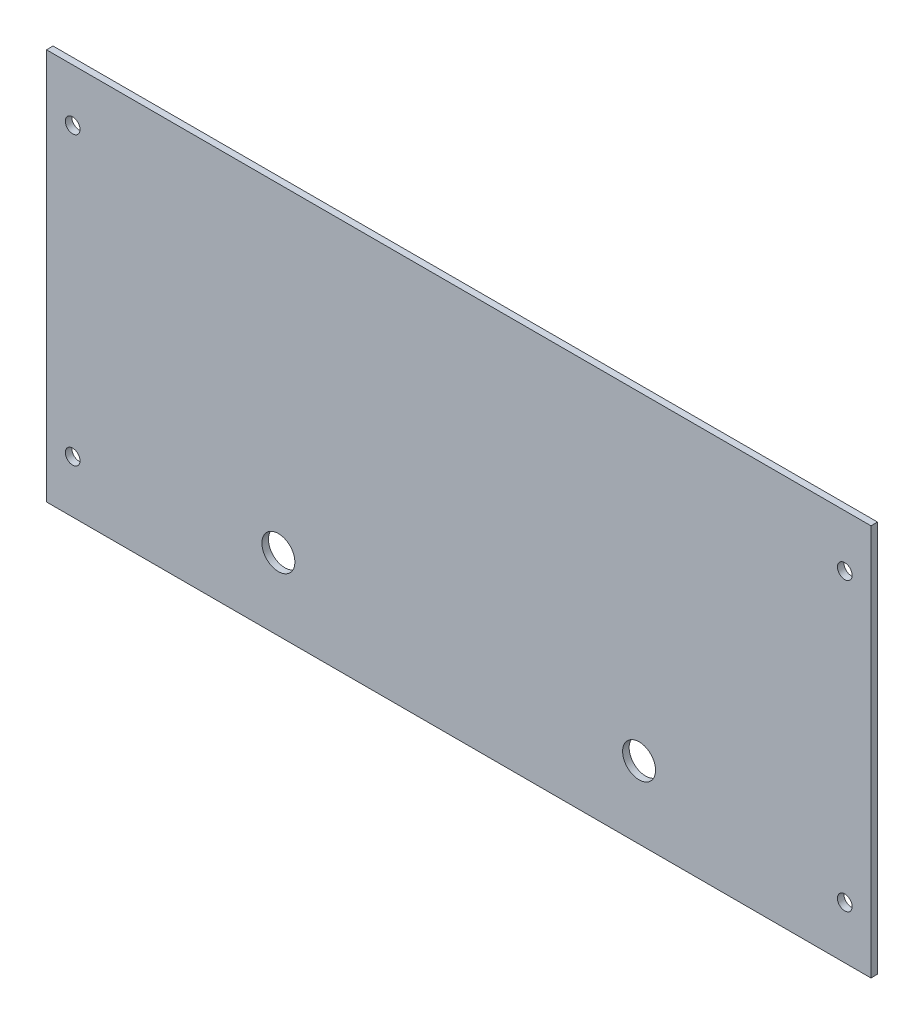
ISO-10303-21;
HEADER;
FILE_DESCRIPTION(('STEP AP214'),'2;1');
FILE_NAME('part.step','',(''),(''),'','','');
FILE_SCHEMA(('AUTOMOTIVE_DESIGN { 1 0 10303 214 1 1 1 1 }'));
ENDSEC;
DATA;
#1=APPLICATION_CONTEXT('core data for automotive mechanical design processes');
#2=APPLICATION_PROTOCOL_DEFINITION('international standard','automotive_design',2000,#1);
#3=PRODUCT_CONTEXT('',#1,'mechanical');
#4=PRODUCT('Part','Part','',(#3));
#5=PRODUCT_RELATED_PRODUCT_CATEGORY('part','',(#4));
#6=PRODUCT_DEFINITION_FORMATION('','',#4);
#7=PRODUCT_DEFINITION_CONTEXT('part definition',#1,'design');
#8=PRODUCT_DEFINITION('design','',#6,#7);
#9=PRODUCT_DEFINITION_SHAPE('','',#8);
#10=(LENGTH_UNIT() NAMED_UNIT(*) SI_UNIT(.MILLI.,.METRE.));
#11=(NAMED_UNIT(*) PLANE_ANGLE_UNIT() SI_UNIT($,.RADIAN.));
#12=(NAMED_UNIT(*) SI_UNIT($,.STERADIAN.) SOLID_ANGLE_UNIT());
#13=UNCERTAINTY_MEASURE_WITH_UNIT(LENGTH_MEASURE(1.E-05),#10,'distance_accuracy_value','');
#14=(GEOMETRIC_REPRESENTATION_CONTEXT(3) GLOBAL_UNCERTAINTY_ASSIGNED_CONTEXT((#13)) GLOBAL_UNIT_ASSIGNED_CONTEXT((#10,
#11,#12)) REPRESENTATION_CONTEXT('',''));
#15=CARTESIAN_POINT('',(0.,0.,0.));
#16=DIRECTION('',(0.,0.,1.));
#17=DIRECTION('',(1.,0.,0.));
#18=AXIS2_PLACEMENT_3D('',#15,#16,#17);
#19=CARTESIAN_POINT('',(0.,0.,3.175));
#20=DIRECTION('',(0.,0.,-1.));
#21=DIRECTION('',(-1.,0.,0.));
#22=AXIS2_PLACEMENT_3D('',#19,#20,#21);
#23=PLANE('',#22);
#24=DIRECTION('',(0.,1.,0.));
#25=VECTOR('',#24,1.);
#26=CARTESIAN_POINT('',(200.,-95.,3.175));
#27=LINE('',#26,#25);
#28=CARTESIAN_POINT('',(200.,-95.,3.175));
#29=VERTEX_POINT('',#28);
#30=CARTESIAN_POINT('',(200.,95.,3.175));
#31=VERTEX_POINT('',#30);
#32=EDGE_CURVE('E89',#29,#31,#27,.T.);
#33=ORIENTED_EDGE('',*,*,#32,.T.);
#34=DIRECTION('',(-1.,0.,0.));
#35=VECTOR('',#34,1.);
#36=CARTESIAN_POINT('',(-200.,95.,3.175));
#37=LINE('',#36,#35);
#38=CARTESIAN_POINT('',(-200.,95.,3.175));
#39=VERTEX_POINT('',#38);
#40=EDGE_CURVE('E84',#31,#39,#37,.T.);
#41=ORIENTED_EDGE('',*,*,#40,.T.);
#42=DIRECTION('',(0.,-1.,0.));
#43=VECTOR('',#42,1.);
#44=CARTESIAN_POINT('',(-200.,-95.,3.175));
#45=LINE('',#44,#43);
#46=CARTESIAN_POINT('',(-200.,-95.,3.175));
#47=VERTEX_POINT('',#46);
#48=EDGE_CURVE('E87',#39,#47,#45,.T.);
#49=ORIENTED_EDGE('',*,*,#48,.T.);
#50=DIRECTION('',(1.,0.,0.));
#51=VECTOR('',#50,1.);
#52=CARTESIAN_POINT('',(-200.,-95.,3.175));
#53=LINE('',#52,#51);
#54=EDGE_CURVE('E54',#47,#29,#53,.T.);
#55=ORIENTED_EDGE('',*,*,#54,.T.);
#56=EDGE_LOOP('',(#33,#41,#49,#55));
#57=FACE_BOUND('',#56,.T.);
#58=CARTESIAN_POINT('',(87.5,-60.,3.175));
#59=DIRECTION('',(0.,0.,1.));
#60=DIRECTION('',(1.,0.,0.));
#61=AXIS2_PLACEMENT_3D('',#58,#59,#60);
#62=CIRCLE('',#61,8.00000000000001);
#63=CARTESIAN_POINT('',(95.5,-60.,3.175));
#64=VERTEX_POINT('',#63);
#65=EDGE_CURVE('E104',#64,#64,#62,.T.);
#66=ORIENTED_EDGE('',*,*,#65,.F.);
#67=EDGE_LOOP('',(#66));
#68=FACE_BOUND('',#67,.T.);
#69=CARTESIAN_POINT('',(-87.5,-60.,3.175));
#70=DIRECTION('',(0.,0.,1.));
#71=DIRECTION('',(1.,0.,0.));
#72=AXIS2_PLACEMENT_3D('',#69,#70,#71);
#73=CIRCLE('',#72,8.00000000000001);
#74=CARTESIAN_POINT('',(-79.5,-60.,3.175));
#75=VERTEX_POINT('',#74);
#76=EDGE_CURVE('E119',#75,#75,#73,.T.);
#77=ORIENTED_EDGE('',*,*,#76,.F.);
#78=EDGE_LOOP('',(#77));
#79=FACE_BOUND('',#78,.T.);
#80=CARTESIAN_POINT('',(-187.3,69.6,3.175));
#81=DIRECTION('',(0.,0.,1.));
#82=DIRECTION('',(1.,0.,0.));
#83=AXIS2_PLACEMENT_3D('',#80,#81,#82);
#84=CIRCLE('',#83,3.56870000000001);
#85=CARTESIAN_POINT('',(-183.7313,69.6,3.175));
#86=VERTEX_POINT('',#85);
#87=EDGE_CURVE('E125',#86,#86,#84,.T.);
#88=ORIENTED_EDGE('',*,*,#87,.F.);
#89=EDGE_LOOP('',(#88));
#90=FACE_BOUND('',#89,.T.);
#91=CARTESIAN_POINT('',(-187.3,-69.6,3.175));
#92=DIRECTION('',(0.,0.,1.));
#93=DIRECTION('',(1.,0.,0.));
#94=AXIS2_PLACEMENT_3D('',#91,#92,#93);
#95=CIRCLE('',#94,3.56870000000001);
#96=CARTESIAN_POINT('',(-183.7313,-69.6,3.175));
#97=VERTEX_POINT('',#96);
#98=EDGE_CURVE('E131',#97,#97,#95,.T.);
#99=ORIENTED_EDGE('',*,*,#98,.F.);
#100=EDGE_LOOP('',(#99));
#101=FACE_BOUND('',#100,.T.);
#102=CARTESIAN_POINT('',(187.3,-69.6,3.175));
#103=DIRECTION('',(0.,0.,1.));
#104=DIRECTION('',(-1.,0.,0.));
#105=AXIS2_PLACEMENT_3D('',#102,#103,#104);
#106=CIRCLE('',#105,3.56870000000001);
#107=CARTESIAN_POINT('',(183.7313,-69.6,3.175));
#108=VERTEX_POINT('',#107);
#109=EDGE_CURVE('E137',#108,#108,#106,.T.);
#110=ORIENTED_EDGE('',*,*,#109,.F.);
#111=EDGE_LOOP('',(#110));
#112=FACE_BOUND('',#111,.T.);
#113=CARTESIAN_POINT('',(187.3,69.6,3.175));
#114=DIRECTION('',(0.,0.,1.));
#115=DIRECTION('',(-1.,0.,0.));
#116=AXIS2_PLACEMENT_3D('',#113,#114,#115);
#117=CIRCLE('',#116,3.56870000000001);
#118=CARTESIAN_POINT('',(183.7313,69.6,3.175));
#119=VERTEX_POINT('',#118);
#120=EDGE_CURVE('E143',#119,#119,#117,.T.);
#121=ORIENTED_EDGE('',*,*,#120,.F.);
#122=EDGE_LOOP('',(#121));
#123=FACE_BOUND('',#122,.T.);
#124=ADVANCED_FACE('F37',(#57,#68,#79,#90,#101,#112,#123),#23,.F.);
#125=CARTESIAN_POINT('',(0.,0.,0.));
#126=DIRECTION('',(0.,0.,-1.));
#127=DIRECTION('',(-1.,0.,0.));
#128=AXIS2_PLACEMENT_3D('',#125,#126,#127);
#129=PLANE('',#128);
#130=CARTESIAN_POINT('',(187.3,-69.6,0.));
#131=DIRECTION('',(0.,0.,1.));
#132=DIRECTION('',(-1.,0.,0.));
#133=AXIS2_PLACEMENT_3D('',#130,#131,#132);
#134=CIRCLE('',#133,3.56870000000001);
#135=CARTESIAN_POINT('',(183.7313,-69.6,0.));
#136=VERTEX_POINT('',#135);
#137=EDGE_CURVE('E140',#136,#136,#134,.T.);
#138=ORIENTED_EDGE('',*,*,#137,.T.);
#139=EDGE_LOOP('',(#138));
#140=FACE_BOUND('',#139,.T.);
#141=CARTESIAN_POINT('',(-187.3,69.6,0.));
#142=DIRECTION('',(0.,0.,1.));
#143=DIRECTION('',(1.,0.,0.));
#144=AXIS2_PLACEMENT_3D('',#141,#142,#143);
#145=CIRCLE('',#144,3.56870000000001);
#146=CARTESIAN_POINT('',(-183.7313,69.6,0.));
#147=VERTEX_POINT('',#146);
#148=EDGE_CURVE('E128',#147,#147,#145,.T.);
#149=ORIENTED_EDGE('',*,*,#148,.T.);
#150=EDGE_LOOP('',(#149));
#151=FACE_BOUND('',#150,.T.);
#152=CARTESIAN_POINT('',(87.5,-60.,0.));
#153=DIRECTION('',(0.,0.,1.));
#154=DIRECTION('',(1.,0.,0.));
#155=AXIS2_PLACEMENT_3D('',#152,#153,#154);
#156=CIRCLE('',#155,8.00000000000001);
#157=CARTESIAN_POINT('',(95.5,-60.,0.));
#158=VERTEX_POINT('',#157);
#159=EDGE_CURVE('E116',#158,#158,#156,.T.);
#160=ORIENTED_EDGE('',*,*,#159,.T.);
#161=EDGE_LOOP('',(#160));
#162=FACE_BOUND('',#161,.T.);
#163=DIRECTION('',(0.,1.,0.));
#164=VECTOR('',#163,1.);
#165=CARTESIAN_POINT('',(200.,-95.,0.));
#166=LINE('',#165,#164);
#167=CARTESIAN_POINT('',(200.,-95.,0.));
#168=VERTEX_POINT('',#167);
#169=CARTESIAN_POINT('',(200.,95.,0.));
#170=VERTEX_POINT('',#169);
#171=EDGE_CURVE('E101',#168,#170,#166,.T.);
#172=ORIENTED_EDGE('',*,*,#171,.F.);
#173=DIRECTION('',(1.,0.,0.));
#174=VECTOR('',#173,1.);
#175=CARTESIAN_POINT('',(-200.,-95.,0.));
#176=LINE('',#175,#174);
#177=CARTESIAN_POINT('',(-200.,-95.,0.));
#178=VERTEX_POINT('',#177);
#179=EDGE_CURVE('E77',#178,#168,#176,.T.);
#180=ORIENTED_EDGE('',*,*,#179,.F.);
#181=DIRECTION('',(0.,-1.,0.));
#182=VECTOR('',#181,1.);
#183=CARTESIAN_POINT('',(-200.,-95.,0.));
#184=LINE('',#183,#182);
#185=CARTESIAN_POINT('',(-200.,95.,0.));
#186=VERTEX_POINT('',#185);
#187=EDGE_CURVE('E71',#186,#178,#184,.T.);
#188=ORIENTED_EDGE('',*,*,#187,.F.);
#189=DIRECTION('',(-1.,0.,0.));
#190=VECTOR('',#189,1.);
#191=CARTESIAN_POINT('',(-200.,95.,0.));
#192=LINE('',#191,#190);
#193=EDGE_CURVE('E93',#170,#186,#192,.T.);
#194=ORIENTED_EDGE('',*,*,#193,.F.);
#195=EDGE_LOOP('',(#172,#180,#188,#194));
#196=FACE_BOUND('',#195,.T.);
#197=CARTESIAN_POINT('',(-87.5,-60.,0.));
#198=DIRECTION('',(0.,0.,1.));
#199=DIRECTION('',(1.,0.,0.));
#200=AXIS2_PLACEMENT_3D('',#197,#198,#199);
#201=CIRCLE('',#200,8.00000000000001);
#202=CARTESIAN_POINT('',(-79.5,-60.,0.));
#203=VERTEX_POINT('',#202);
#204=EDGE_CURVE('E122',#203,#203,#201,.T.);
#205=ORIENTED_EDGE('',*,*,#204,.T.);
#206=EDGE_LOOP('',(#205));
#207=FACE_BOUND('',#206,.T.);
#208=CARTESIAN_POINT('',(-187.3,-69.6,0.));
#209=DIRECTION('',(0.,0.,1.));
#210=DIRECTION('',(1.,0.,0.));
#211=AXIS2_PLACEMENT_3D('',#208,#209,#210);
#212=CIRCLE('',#211,3.56870000000001);
#213=CARTESIAN_POINT('',(-183.7313,-69.6,0.));
#214=VERTEX_POINT('',#213);
#215=EDGE_CURVE('E134',#214,#214,#212,.T.);
#216=ORIENTED_EDGE('',*,*,#215,.T.);
#217=EDGE_LOOP('',(#216));
#218=FACE_BOUND('',#217,.T.);
#219=CARTESIAN_POINT('',(187.3,69.6,0.));
#220=DIRECTION('',(0.,0.,1.));
#221=DIRECTION('',(-1.,0.,0.));
#222=AXIS2_PLACEMENT_3D('',#219,#220,#221);
#223=CIRCLE('',#222,3.56870000000001);
#224=CARTESIAN_POINT('',(183.7313,69.6,0.));
#225=VERTEX_POINT('',#224);
#226=EDGE_CURVE('E146',#225,#225,#223,.T.);
#227=ORIENTED_EDGE('',*,*,#226,.T.);
#228=EDGE_LOOP('',(#227));
#229=FACE_BOUND('',#228,.T.);
#230=ADVANCED_FACE('F112',(#140,#151,#162,#196,#207,#218,#229),#129,.T.);
#231=CARTESIAN_POINT('',(200.,-95.,3.175));
#232=DIRECTION('',(-1.,0.,0.));
#233=DIRECTION('',(0.,0.,1.));
#234=AXIS2_PLACEMENT_3D('',#231,#232,#233);
#235=PLANE('',#234);
#236=ORIENTED_EDGE('',*,*,#171,.T.);
#237=DIRECTION('',(0.,0.,-1.));
#238=VECTOR('',#237,1.);
#239=CARTESIAN_POINT('',(200.,95.,3.175));
#240=LINE('',#239,#238);
#241=EDGE_CURVE('E11',#31,#170,#240,.T.);
#242=ORIENTED_EDGE('',*,*,#241,.F.);
#243=ORIENTED_EDGE('',*,*,#32,.F.);
#244=DIRECTION('',(0.,0.,-1.));
#245=VECTOR('',#244,1.);
#246=CARTESIAN_POINT('',(200.,-95.,3.175));
#247=LINE('',#246,#245);
#248=EDGE_CURVE('E97',#29,#168,#247,.T.);
#249=ORIENTED_EDGE('',*,*,#248,.T.);
#250=EDGE_LOOP('',(#236,#242,#243,#249));
#251=FACE_BOUND('',#250,.T.);
#252=ADVANCED_FACE('F39',(#251),#235,.F.);
#253=CARTESIAN_POINT('',(-200.,95.,3.175));
#254=DIRECTION('',(0.,-1.,0.));
#255=DIRECTION('',(0.,0.,-1.));
#256=AXIS2_PLACEMENT_3D('',#253,#254,#255);
#257=PLANE('',#256);
#258=ORIENTED_EDGE('',*,*,#193,.T.);
#259=DIRECTION('',(0.,0.,-1.));
#260=VECTOR('',#259,1.);
#261=CARTESIAN_POINT('',(-200.,95.,3.175));
#262=LINE('',#261,#260);
#263=EDGE_CURVE('E46',#39,#186,#262,.T.);
#264=ORIENTED_EDGE('',*,*,#263,.F.);
#265=ORIENTED_EDGE('',*,*,#40,.F.);
#266=ORIENTED_EDGE('',*,*,#241,.T.);
#267=EDGE_LOOP('',(#258,#264,#265,#266));
#268=FACE_BOUND('',#267,.T.);
#269=ADVANCED_FACE('F92',(#268),#257,.F.);
#270=CARTESIAN_POINT('',(-200.,-95.,3.175));
#271=DIRECTION('',(1.,0.,0.));
#272=DIRECTION('',(0.,0.,-1.));
#273=AXIS2_PLACEMENT_3D('',#270,#271,#272);
#274=PLANE('',#273);
#275=ORIENTED_EDGE('',*,*,#187,.T.);
#276=DIRECTION('',(0.,0.,-1.));
#277=VECTOR('',#276,1.);
#278=CARTESIAN_POINT('',(-200.,-95.,3.175));
#279=LINE('',#278,#277);
#280=EDGE_CURVE('E94',#47,#178,#279,.T.);
#281=ORIENTED_EDGE('',*,*,#280,.F.);
#282=ORIENTED_EDGE('',*,*,#48,.F.);
#283=ORIENTED_EDGE('',*,*,#263,.T.);
#284=EDGE_LOOP('',(#275,#281,#282,#283));
#285=FACE_BOUND('',#284,.T.);
#286=ADVANCED_FACE('F95',(#285),#274,.F.);
#287=CARTESIAN_POINT('',(-200.,-95.,3.175));
#288=DIRECTION('',(0.,1.,0.));
#289=DIRECTION('',(0.,0.,1.));
#290=AXIS2_PLACEMENT_3D('',#287,#288,#289);
#291=PLANE('',#290);
#292=ORIENTED_EDGE('',*,*,#179,.T.);
#293=ORIENTED_EDGE('',*,*,#248,.F.);
#294=ORIENTED_EDGE('',*,*,#54,.F.);
#295=ORIENTED_EDGE('',*,*,#280,.T.);
#296=EDGE_LOOP('',(#292,#293,#294,#295));
#297=FACE_BOUND('',#296,.T.);
#298=ADVANCED_FACE('F109',(#297),#291,.F.);
#299=CARTESIAN_POINT('',(87.5,-60.,3.175));
#300=DIRECTION('',(0.,0.,-1.));
#301=DIRECTION('',(-1.,0.,0.));
#302=AXIS2_PLACEMENT_3D('',#299,#300,#301);
#303=CYLINDRICAL_SURFACE('',#302,8.00000000000001);
#304=ORIENTED_EDGE('',*,*,#65,.T.);
#305=EDGE_LOOP('',(#304));
#306=FACE_BOUND('',#305,.T.);
#307=ORIENTED_EDGE('',*,*,#159,.F.);
#308=EDGE_LOOP('',(#307));
#309=FACE_BOUND('',#308,.T.);
#310=ADVANCED_FACE('F163',(#306,#309),#303,.F.);
#311=CARTESIAN_POINT('',(-87.5,-60.,3.175));
#312=DIRECTION('',(0.,0.,-1.));
#313=DIRECTION('',(-1.,0.,0.));
#314=AXIS2_PLACEMENT_3D('',#311,#312,#313);
#315=CYLINDRICAL_SURFACE('',#314,8.00000000000001);
#316=ORIENTED_EDGE('',*,*,#76,.T.);
#317=EDGE_LOOP('',(#316));
#318=FACE_BOUND('',#317,.T.);
#319=ORIENTED_EDGE('',*,*,#204,.F.);
#320=EDGE_LOOP('',(#319));
#321=FACE_BOUND('',#320,.T.);
#322=ADVANCED_FACE('F217',(#318,#321),#315,.F.);
#323=CARTESIAN_POINT('',(-187.3,69.6,3.175));
#324=DIRECTION('',(0.,0.,-1.));
#325=DIRECTION('',(-1.,0.,0.));
#326=AXIS2_PLACEMENT_3D('',#323,#324,#325);
#327=CYLINDRICAL_SURFACE('',#326,3.56870000000001);
#328=ORIENTED_EDGE('',*,*,#87,.T.);
#329=EDGE_LOOP('',(#328));
#330=FACE_BOUND('',#329,.T.);
#331=ORIENTED_EDGE('',*,*,#148,.F.);
#332=EDGE_LOOP('',(#331));
#333=FACE_BOUND('',#332,.T.);
#334=ADVANCED_FACE('F226',(#330,#333),#327,.F.);
#335=CARTESIAN_POINT('',(-187.3,-69.6,3.175));
#336=DIRECTION('',(0.,0.,-1.));
#337=DIRECTION('',(-1.,0.,0.));
#338=AXIS2_PLACEMENT_3D('',#335,#336,#337);
#339=CYLINDRICAL_SURFACE('',#338,3.56870000000001);
#340=ORIENTED_EDGE('',*,*,#98,.T.);
#341=EDGE_LOOP('',(#340));
#342=FACE_BOUND('',#341,.T.);
#343=ORIENTED_EDGE('',*,*,#215,.F.);
#344=EDGE_LOOP('',(#343));
#345=FACE_BOUND('',#344,.T.);
#346=ADVANCED_FACE('F235',(#342,#345),#339,.F.);
#347=CARTESIAN_POINT('',(187.3,-69.6,3.175));
#348=DIRECTION('',(0.,0.,-1.));
#349=DIRECTION('',(-1.,0.,0.));
#350=AXIS2_PLACEMENT_3D('',#347,#348,#349);
#351=CYLINDRICAL_SURFACE('',#350,3.56870000000001);
#352=ORIENTED_EDGE('',*,*,#109,.T.);
#353=EDGE_LOOP('',(#352));
#354=FACE_BOUND('',#353,.T.);
#355=ORIENTED_EDGE('',*,*,#137,.F.);
#356=EDGE_LOOP('',(#355));
#357=FACE_BOUND('',#356,.T.);
#358=ADVANCED_FACE('F245',(#354,#357),#351,.F.);
#359=CARTESIAN_POINT('',(187.3,69.6,3.175));
#360=DIRECTION('',(0.,0.,-1.));
#361=DIRECTION('',(-1.,0.,0.));
#362=AXIS2_PLACEMENT_3D('',#359,#360,#361);
#363=CYLINDRICAL_SURFACE('',#362,3.56870000000001);
#364=ORIENTED_EDGE('',*,*,#120,.T.);
#365=EDGE_LOOP('',(#364));
#366=FACE_BOUND('',#365,.T.);
#367=ORIENTED_EDGE('',*,*,#226,.F.);
#368=EDGE_LOOP('',(#367));
#369=FACE_BOUND('',#368,.T.);
#370=ADVANCED_FACE('F152',(#366,#369),#363,.F.);
#371=CLOSED_SHELL('',(#124,#230,#252,#269,#286,#298,#310,#322,#334,#346,#358,#370));
#372=MANIFOLD_SOLID_BREP('B2',#371);
#373=ADVANCED_BREP_SHAPE_REPRESENTATION('',(#18,#372),#14);
#374=SHAPE_DEFINITION_REPRESENTATION(#9,#373);
ENDSEC;
END-ISO-10303-21;
